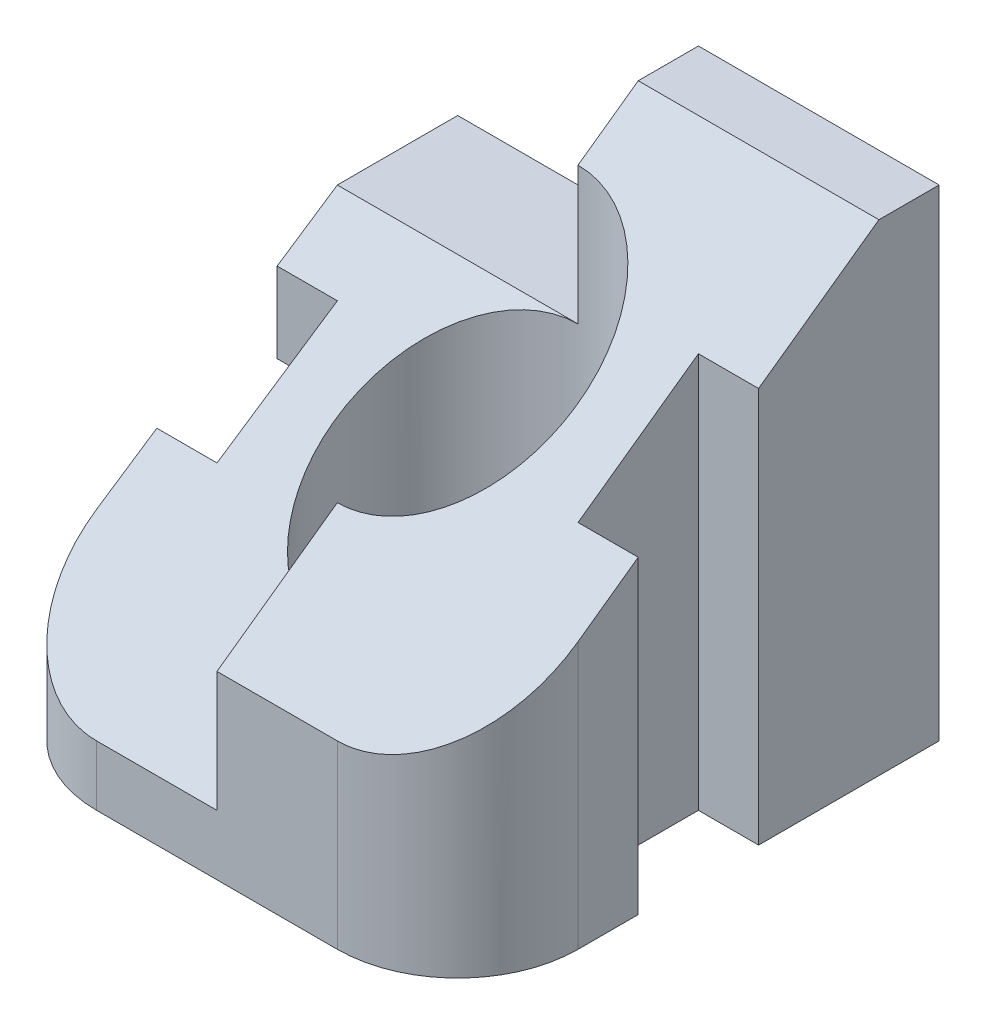
ISO-10303-21;
HEADER;
FILE_DESCRIPTION(('STEP AP214'),'2;1');
FILE_NAME('part.step','',(''),(''),'','','');
FILE_SCHEMA(('AUTOMOTIVE_DESIGN { 1 0 10303 214 1 1 1 1 }'));
ENDSEC;
DATA;
#1=APPLICATION_CONTEXT('core data for automotive mechanical design processes');
#2=APPLICATION_PROTOCOL_DEFINITION('international standard','automotive_design',2000,#1);
#3=PRODUCT_CONTEXT('',#1,'mechanical');
#4=PRODUCT('Part','Part','',(#3));
#5=PRODUCT_RELATED_PRODUCT_CATEGORY('part','',(#4));
#6=PRODUCT_DEFINITION_FORMATION('','',#4);
#7=PRODUCT_DEFINITION_CONTEXT('part definition',#1,'design');
#8=PRODUCT_DEFINITION('design','',#6,#7);
#9=PRODUCT_DEFINITION_SHAPE('','',#8);
#10=(LENGTH_UNIT() NAMED_UNIT(*) SI_UNIT(.MILLI.,.METRE.));
#11=(NAMED_UNIT(*) PLANE_ANGLE_UNIT() SI_UNIT($,.RADIAN.));
#12=(NAMED_UNIT(*) SI_UNIT($,.STERADIAN.) SOLID_ANGLE_UNIT());
#13=UNCERTAINTY_MEASURE_WITH_UNIT(LENGTH_MEASURE(1.E-05),#10,'distance_accuracy_value','');
#14=(GEOMETRIC_REPRESENTATION_CONTEXT(3) GLOBAL_UNCERTAINTY_ASSIGNED_CONTEXT((#13)) GLOBAL_UNIT_ASSIGNED_CONTEXT((#10,
#11,#12)) REPRESENTATION_CONTEXT('',''));
#15=CARTESIAN_POINT('',(0.,0.,0.));
#16=DIRECTION('',(0.,0.,1.));
#17=DIRECTION('',(1.,0.,0.));
#18=AXIS2_PLACEMENT_3D('',#15,#16,#17);
#19=CARTESIAN_POINT('',(-20.,20.,40.));
#20=DIRECTION('',(1.,0.,0.));
#21=DIRECTION('',(0.,0.,-1.));
#22=AXIS2_PLACEMENT_3D('',#19,#20,#21);
#23=PLANE('',#22);
#24=DIRECTION('',(0.,0.554700196225229,-0.832050294337844));
#25=VECTOR('',#24,1.);
#26=CARTESIAN_POINT('',(-20.,4.99999999999999,10.));
#27=LINE('',#26,#25);
#28=CARTESIAN_POINT('',(-20.,-8.33333333333334,30.));
#29=VERTEX_POINT('',#28);
#30=CARTESIAN_POINT('',(-20.,-5.00000000000001,25.));
#31=VERTEX_POINT('',#30);
#32=EDGE_CURVE('E191',#29,#31,#27,.T.);
#33=ORIENTED_EDGE('',*,*,#32,.T.);
#34=DIRECTION('',(0.,1.,0.));
#35=VECTOR('',#34,1.);
#36=CARTESIAN_POINT('',(-20.,-20.,25.));
#37=LINE('',#36,#35);
#38=CARTESIAN_POINT('',(-20.,-20.,25.));
#39=VERTEX_POINT('',#38);
#40=EDGE_CURVE('E265',#39,#31,#37,.T.);
#41=ORIENTED_EDGE('',*,*,#40,.F.);
#42=DIRECTION('',(0.,0.,-1.));
#43=VECTOR('',#42,1.);
#44=CARTESIAN_POINT('',(-20.,-20.,40.));
#45=LINE('',#44,#43);
#46=CARTESIAN_POINT('',(-20.,-20.,30.));
#47=VERTEX_POINT('',#46);
#48=EDGE_CURVE('E316',#47,#39,#45,.T.);
#49=ORIENTED_EDGE('',*,*,#48,.F.);
#50=DIRECTION('',(0.,1.,0.));
#51=VECTOR('',#50,1.);
#52=CARTESIAN_POINT('',(-20.,-20.,30.));
#53=LINE('',#52,#51);
#54=EDGE_CURVE('E254',#47,#29,#53,.T.);
#55=ORIENTED_EDGE('',*,*,#54,.T.);
#56=EDGE_LOOP('',(#33,#41,#49,#55));
#57=FACE_BOUND('',#56,.T.);
#58=ADVANCED_FACE('F33',(#57),#23,.F.);
#59=CARTESIAN_POINT('',(0.,0.,40.));
#60=DIRECTION('',(0.,0.,1.));
#61=DIRECTION('',(1.,0.,0.));
#62=AXIS2_PLACEMENT_3D('',#59,#60,#61);
#63=PLANE('',#62);
#64=DIRECTION('',(1.,0.,0.));
#65=VECTOR('',#64,1.);
#66=CARTESIAN_POINT('',(0.,-5.00000000000001,40.));
#67=LINE('',#66,#65);
#68=CARTESIAN_POINT('',(0.,-5.00000000000001,40.));
#69=VERTEX_POINT('',#68);
#70=CARTESIAN_POINT('',(10.,-5.00000000000001,40.));
#71=VERTEX_POINT('',#70);
#72=EDGE_CURVE('E173',#69,#71,#67,.T.);
#73=ORIENTED_EDGE('',*,*,#72,.F.);
#74=DIRECTION('',(0.,-1.,0.));
#75=VECTOR('',#74,1.);
#76=CARTESIAN_POINT('',(0.,-15.,40.));
#77=LINE('',#76,#75);
#78=CARTESIAN_POINT('',(0.,-15.,40.));
#79=VERTEX_POINT('',#78);
#80=EDGE_CURVE('E182',#69,#79,#77,.T.);
#81=ORIENTED_EDGE('',*,*,#80,.T.);
#82=DIRECTION('',(-1.,0.,0.));
#83=VECTOR('',#82,1.);
#84=CARTESIAN_POINT('',(0.,-15.,40.));
#85=LINE('',#84,#83);
#86=CARTESIAN_POINT('',(-10.,-15.,40.));
#87=VERTEX_POINT('',#86);
#88=EDGE_CURVE('E203',#79,#87,#85,.T.);
#89=ORIENTED_EDGE('',*,*,#88,.T.);
#90=DIRECTION('',(0.,1.,0.));
#91=VECTOR('',#90,1.);
#92=CARTESIAN_POINT('',(-10.,-20.,40.));
#93=LINE('',#92,#91);
#94=CARTESIAN_POINT('',(-10.,-20.,40.));
#95=VERTEX_POINT('',#94);
#96=EDGE_CURVE('E255',#95,#87,#93,.T.);
#97=ORIENTED_EDGE('',*,*,#96,.F.);
#98=DIRECTION('',(1.,0.,0.));
#99=VECTOR('',#98,1.);
#100=CARTESIAN_POINT('',(-20.,-20.,40.));
#101=LINE('',#100,#99);
#102=CARTESIAN_POINT('',(10.,-20.,40.));
#103=VERTEX_POINT('',#102);
#104=EDGE_CURVE('E302',#95,#103,#101,.T.);
#105=ORIENTED_EDGE('',*,*,#104,.T.);
#106=DIRECTION('',(0.,1.,0.));
#107=VECTOR('',#106,1.);
#108=CARTESIAN_POINT('',(10.,-20.,40.));
#109=LINE('',#108,#107);
#110=EDGE_CURVE('E56',#103,#71,#109,.T.);
#111=ORIENTED_EDGE('',*,*,#110,.T.);
#112=EDGE_LOOP('',(#73,#81,#89,#97,#105,#111));
#113=FACE_BOUND('',#112,.T.);
#114=ADVANCED_FACE('F180',(#113),#63,.T.);
#115=CARTESIAN_POINT('',(-20.,1.66666666666666,15.));
#116=VERTEX_POINT('',#115);
#117=CARTESIAN_POINT('',(-20.,4.99999999999999,10.));
#118=VERTEX_POINT('',#117);
#119=EDGE_CURVE('E196',#116,#118,#27,.T.);
#120=ORIENTED_EDGE('',*,*,#119,.T.);
#121=DIRECTION('',(0.,0.,1.));
#122=VECTOR('',#121,1.);
#123=CARTESIAN_POINT('',(-20.,5.,15.));
#124=LINE('',#123,#122);
#125=CARTESIAN_POINT('',(-20.,4.99999999999999,0.));
#126=VERTEX_POINT('',#125);
#127=EDGE_CURVE('E218',#126,#118,#124,.T.);
#128=ORIENTED_EDGE('',*,*,#127,.F.);
#129=DIRECTION('',(0.,-1.,0.));
#130=VECTOR('',#129,1.);
#131=CARTESIAN_POINT('',(-20.,20.,0.));
#132=LINE('',#131,#130);
#133=CARTESIAN_POINT('',(-20.,-5.00000000000001,0.));
#134=VERTEX_POINT('',#133);
#135=EDGE_CURVE('E311',#126,#134,#132,.T.);
#136=ORIENTED_EDGE('',*,*,#135,.T.);
#137=DIRECTION('',(0.,0.,-1.));
#138=VECTOR('',#137,1.);
#139=CARTESIAN_POINT('',(-20.,-5.00000000000001,0.));
#140=LINE('',#139,#138);
#141=CARTESIAN_POINT('',(-20.,-5.00000000000001,15.));
#142=VERTEX_POINT('',#141);
#143=EDGE_CURVE('E231',#142,#134,#140,.T.);
#144=ORIENTED_EDGE('',*,*,#143,.F.);
#145=DIRECTION('',(0.,1.,0.));
#146=VECTOR('',#145,1.);
#147=CARTESIAN_POINT('',(-20.,-20.,15.));
#148=LINE('',#147,#146);
#149=EDGE_CURVE('E266',#142,#116,#148,.T.);
#150=ORIENTED_EDGE('',*,*,#149,.T.);
#151=EDGE_LOOP('',(#120,#128,#136,#144,#150));
#152=FACE_BOUND('',#151,.T.);
#153=ADVANCED_FACE('F352',(#152),#23,.F.);
#154=CARTESIAN_POINT('',(0.,-20.,20.));
#155=DIRECTION('',(0.,1.,0.));
#156=DIRECTION('',(0.,0.,1.));
#157=AXIS2_PLACEMENT_3D('',#154,#155,#156);
#158=CYLINDRICAL_SURFACE('',#157,10.);
#159=CARTESIAN_POINT('',(0.,-20.,20.));
#160=DIRECTION('',(0.,1.,0.));
#161=DIRECTION('',(0.,0.,1.));
#162=AXIS2_PLACEMENT_3D('',#159,#160,#161);
#163=CIRCLE('',#162,10.);
#164=CARTESIAN_POINT('',(0.,-20.,30.));
#165=VERTEX_POINT('',#164);
#166=EDGE_CURVE('E290',#165,#165,#163,.T.);
#167=ORIENTED_EDGE('',*,*,#166,.F.);
#168=EDGE_LOOP('',(#167));
#169=FACE_BOUND('',#168,.T.);
#170=DIRECTION('',(0.,1.,0.));
#171=VECTOR('',#170,1.);
#172=CARTESIAN_POINT('',(0.,-20.,30.));
#173=LINE('',#172,#171);
#174=CARTESIAN_POINT('',(0.,-8.33333333333334,30.));
#175=VERTEX_POINT('',#174);
#176=CARTESIAN_POINT('',(0.,2.14285714285712,30.));
#177=VERTEX_POINT('',#176);
#178=EDGE_CURVE('E205',#175,#177,#173,.T.);
#179=ORIENTED_EDGE('',*,*,#178,.T.);
#180=CARTESIAN_POINT('',(0.,9.28571428571428,20.));
#181=DIRECTION('',(0.,-0.813733471206735,-0.581238193719096));
#182=DIRECTION('',(0.,0.581238193719096,-0.813733471206735));
#183=AXIS2_PLACEMENT_3D('',#180,#181,#182);
#184=ELLIPSE('',#183,12.2890360957752,10.);
#185=CARTESIAN_POINT('',(0.,16.4285714285714,9.99999999999999));
#186=VERTEX_POINT('',#185);
#187=EDGE_CURVE('E48',#177,#186,#184,.F.);
#188=ORIENTED_EDGE('',*,*,#187,.T.);
#189=DIRECTION('',(0.,1.,0.));
#190=VECTOR('',#189,1.);
#191=CARTESIAN_POINT('',(0.,-20.,9.99999999999999));
#192=LINE('',#191,#190);
#193=CARTESIAN_POINT('',(0.,4.99999999999999,10.));
#194=VERTEX_POINT('',#193);
#195=EDGE_CURVE('E11',#186,#194,#192,.F.);
#196=ORIENTED_EDGE('',*,*,#195,.T.);
#197=CARTESIAN_POINT('',(0.,-1.66666666666667,20.));
#198=DIRECTION('',(0.,0.832050294337844,0.554700196225229));
#199=DIRECTION('',(0.,0.554700196225229,-0.832050294337844));
#200=AXIS2_PLACEMENT_3D('',#197,#198,#199);
#201=ELLIPSE('',#200,12.0185042515466,10.);
#202=EDGE_CURVE('E215',#175,#194,#201,.F.);
#203=ORIENTED_EDGE('',*,*,#202,.F.);
#204=EDGE_LOOP('',(#179,#188,#196,#203));
#205=FACE_BOUND('',#204,.T.);
#206=ADVANCED_FACE('F378',(#169,#205),#158,.F.);
#207=CARTESIAN_POINT('',(-20.,-20.,15.));
#208=DIRECTION('',(0.,0.,-1.));
#209=DIRECTION('',(-1.,0.,0.));
#210=AXIS2_PLACEMENT_3D('',#207,#208,#209);
#211=PLANE('',#210);
#212=DIRECTION('',(1.,0.,0.));
#213=VECTOR('',#212,1.);
#214=CARTESIAN_POINT('',(-20.,1.66666666666666,15.));
#215=LINE('',#214,#213);
#216=CARTESIAN_POINT('',(-15.,1.66666666666666,15.));
#217=VERTEX_POINT('',#216);
#218=EDGE_CURVE('E213',#116,#217,#215,.T.);
#219=ORIENTED_EDGE('',*,*,#218,.F.);
#220=ORIENTED_EDGE('',*,*,#149,.F.);
#221=DIRECTION('',(-1.,0.,0.));
#222=VECTOR('',#221,1.);
#223=CARTESIAN_POINT('',(-15.,-5.00000000000001,15.));
#224=LINE('',#223,#222);
#225=CARTESIAN_POINT('',(-15.,-5.00000000000001,15.));
#226=VERTEX_POINT('',#225);
#227=EDGE_CURVE('E238',#226,#142,#224,.T.);
#228=ORIENTED_EDGE('',*,*,#227,.F.);
#229=DIRECTION('',(0.,1.,0.));
#230=VECTOR('',#229,1.);
#231=CARTESIAN_POINT('',(-15.,-20.,15.));
#232=LINE('',#231,#230);
#233=EDGE_CURVE('E270',#226,#217,#232,.T.);
#234=ORIENTED_EDGE('',*,*,#233,.T.);
#235=EDGE_LOOP('',(#219,#220,#228,#234));
#236=FACE_BOUND('',#235,.T.);
#237=ADVANCED_FACE('F350',(#236),#211,.F.);
#238=CARTESIAN_POINT('',(-15.,-20.,15.));
#239=DIRECTION('',(1.,0.,0.));
#240=DIRECTION('',(0.,0.,-1.));
#241=AXIS2_PLACEMENT_3D('',#238,#239,#240);
#242=PLANE('',#241);
#243=DIRECTION('',(0.,-0.554700196225229,0.832050294337844));
#244=VECTOR('',#243,1.);
#245=CARTESIAN_POINT('',(-15.,-5.00000000000001,25.));
#246=LINE('',#245,#244);
#247=CARTESIAN_POINT('',(-15.,-5.00000000000001,25.));
#248=VERTEX_POINT('',#247);
#249=EDGE_CURVE('E211',#217,#248,#246,.T.);
#250=ORIENTED_EDGE('',*,*,#249,.F.);
#251=ORIENTED_EDGE('',*,*,#233,.F.);
#252=DIRECTION('',(0.,0.,-1.));
#253=VECTOR('',#252,1.);
#254=CARTESIAN_POINT('',(-15.,-5.00000000000001,0.));
#255=LINE('',#254,#253);
#256=CARTESIAN_POINT('',(-15.,-5.00000000000001,0.));
#257=VERTEX_POINT('',#256);
#258=EDGE_CURVE('E232',#226,#257,#255,.T.);
#259=ORIENTED_EDGE('',*,*,#258,.T.);
#260=DIRECTION('',(0.,-1.,0.));
#261=VECTOR('',#260,1.);
#262=CARTESIAN_POINT('',(-15.,-20.,0.));
#263=LINE('',#262,#261);
#264=CARTESIAN_POINT('',(-15.,-20.,0.));
#265=VERTEX_POINT('',#264);
#266=EDGE_CURVE('E235',#257,#265,#263,.T.);
#267=ORIENTED_EDGE('',*,*,#266,.T.);
#268=DIRECTION('',(0.,0.,-1.));
#269=VECTOR('',#268,1.);
#270=CARTESIAN_POINT('',(-15.,-20.,15.));
#271=LINE('',#270,#269);
#272=CARTESIAN_POINT('',(-15.,-20.,25.));
#273=VERTEX_POINT('',#272);
#274=EDGE_CURVE('E263',#273,#265,#271,.T.);
#275=ORIENTED_EDGE('',*,*,#274,.F.);
#276=DIRECTION('',(0.,1.,0.));
#277=VECTOR('',#276,1.);
#278=CARTESIAN_POINT('',(-15.,-20.,25.));
#279=LINE('',#278,#277);
#280=EDGE_CURVE('E273',#273,#248,#279,.T.);
#281=ORIENTED_EDGE('',*,*,#280,.T.);
#282=EDGE_LOOP('',(#250,#251,#259,#267,#275,#281));
#283=FACE_BOUND('',#282,.T.);
#284=ADVANCED_FACE('F340',(#283),#242,.F.);
#285=CARTESIAN_POINT('',(-15.,-20.,25.));
#286=DIRECTION('',(0.,0.,1.));
#287=DIRECTION('',(1.,0.,0.));
#288=AXIS2_PLACEMENT_3D('',#285,#286,#287);
#289=PLANE('',#288);
#290=DIRECTION('',(-1.,0.,0.));
#291=VECTOR('',#290,1.);
#292=CARTESIAN_POINT('',(-15.,-5.00000000000001,25.));
#293=LINE('',#292,#291);
#294=EDGE_CURVE('E209',#248,#31,#293,.T.);
#295=ORIENTED_EDGE('',*,*,#294,.F.);
#296=ORIENTED_EDGE('',*,*,#280,.F.);
#297=DIRECTION('',(1.,0.,0.));
#298=VECTOR('',#297,1.);
#299=CARTESIAN_POINT('',(-15.,-20.,25.));
#300=LINE('',#299,#298);
#301=EDGE_CURVE('E258',#39,#273,#300,.T.);
#302=ORIENTED_EDGE('',*,*,#301,.F.);
#303=ORIENTED_EDGE('',*,*,#40,.T.);
#304=EDGE_LOOP('',(#295,#296,#302,#303));
#305=FACE_BOUND('',#304,.T.);
#306=ADVANCED_FACE('F393',(#305),#289,.F.);
#307=CARTESIAN_POINT('',(-10.,-20.,30.));
#308=DIRECTION('',(0.,1.,0.));
#309=DIRECTION('',(0.,0.,1.));
#310=AXIS2_PLACEMENT_3D('',#307,#308,#309);
#311=CYLINDRICAL_SURFACE('',#310,10.);
#312=CARTESIAN_POINT('',(-10.,-8.33333333333334,30.));
#313=DIRECTION('',(0.,0.832050294337844,0.554700196225229));
#314=DIRECTION('',(0.,0.554700196225229,-0.832050294337844));
#315=AXIS2_PLACEMENT_3D('',#312,#313,#314);
#316=ELLIPSE('',#315,12.0185042515466,10.);
#317=EDGE_CURVE('E207',#29,#87,#316,.T.);
#318=ORIENTED_EDGE('',*,*,#317,.F.);
#319=ORIENTED_EDGE('',*,*,#54,.F.);
#320=CARTESIAN_POINT('',(-10.,-20.,30.));
#321=DIRECTION('',(0.,-1.,0.));
#322=DIRECTION('',(0.,0.,-1.));
#323=AXIS2_PLACEMENT_3D('',#320,#321,#322);
#324=CIRCLE('',#323,10.);
#325=EDGE_CURVE('E250',#95,#47,#324,.T.);
#326=ORIENTED_EDGE('',*,*,#325,.F.);
#327=ORIENTED_EDGE('',*,*,#96,.T.);
#328=EDGE_LOOP('',(#318,#319,#326,#327));
#329=FACE_BOUND('',#328,.T.);
#330=ADVANCED_FACE('F386',(#329),#311,.T.);
#331=CARTESIAN_POINT('',(0.,5.,15.));
#332=DIRECTION('',(0.,-1.,0.));
#333=DIRECTION('',(0.,0.,-1.));
#334=AXIS2_PLACEMENT_3D('',#331,#332,#333);
#335=PLANE('',#334);
#336=DIRECTION('',(-1.,0.,0.));
#337=VECTOR('',#336,1.);
#338=CARTESIAN_POINT('',(0.,4.99999999999999,10.));
#339=LINE('',#338,#337);
#340=EDGE_CURVE('E193',#194,#118,#339,.T.);
#341=ORIENTED_EDGE('',*,*,#340,.F.);
#342=DIRECTION('',(0.,0.,1.));
#343=VECTOR('',#342,1.);
#344=CARTESIAN_POINT('',(0.,5.,15.));
#345=LINE('',#344,#343);
#346=CARTESIAN_POINT('',(0.,4.99999999999999,0.));
#347=VERTEX_POINT('',#346);
#348=EDGE_CURVE('E222',#347,#194,#345,.T.);
#349=ORIENTED_EDGE('',*,*,#348,.F.);
#350=DIRECTION('',(-1.,0.,0.));
#351=VECTOR('',#350,1.);
#352=CARTESIAN_POINT('',(0.,4.99999999999999,0.));
#353=LINE('',#352,#351);
#354=EDGE_CURVE('E227',#347,#126,#353,.T.);
#355=ORIENTED_EDGE('',*,*,#354,.T.);
#356=ORIENTED_EDGE('',*,*,#127,.T.);
#357=EDGE_LOOP('',(#341,#349,#355,#356));
#358=FACE_BOUND('',#357,.T.);
#359=ADVANCED_FACE('F356',(#358),#335,.F.);
#360=CARTESIAN_POINT('',(20.,20.,40.));
#361=DIRECTION('',(-1.,0.,0.));
#362=DIRECTION('',(0.,0.,1.));
#363=AXIS2_PLACEMENT_3D('',#360,#361,#362);
#364=PLANE('',#363);
#365=DIRECTION('',(0.,1.,0.));
#366=VECTOR('',#365,1.);
#367=CARTESIAN_POINT('',(20.,-20.,25.));
#368=LINE('',#367,#366);
#369=CARTESIAN_POINT('',(20.,-20.,25.));
#370=VERTEX_POINT('',#369);
#371=CARTESIAN_POINT('',(20.,5.71428571428571,25.));
#372=VERTEX_POINT('',#371);
#373=EDGE_CURVE('E287',#370,#372,#368,.T.);
#374=ORIENTED_EDGE('',*,*,#373,.T.);
#375=DIRECTION('',(0.,0.581238193719096,-0.813733471206735));
#376=VECTOR('',#375,1.);
#377=CARTESIAN_POINT('',(20.,20.,5.));
#378=LINE('',#377,#376);
#379=CARTESIAN_POINT('',(20.,2.14285714285714,30.));
#380=VERTEX_POINT('',#379);
#381=EDGE_CURVE('E361',#380,#372,#378,.T.);
#382=ORIENTED_EDGE('',*,*,#381,.F.);
#383=DIRECTION('',(0.,1.,0.));
#384=VECTOR('',#383,1.);
#385=CARTESIAN_POINT('',(20.,-20.,30.));
#386=LINE('',#385,#384);
#387=CARTESIAN_POINT('',(20.,-20.,30.));
#388=VERTEX_POINT('',#387);
#389=EDGE_CURVE('E247',#388,#380,#386,.T.);
#390=ORIENTED_EDGE('',*,*,#389,.F.);
#391=DIRECTION('',(0.,0.,-1.));
#392=VECTOR('',#391,1.);
#393=CARTESIAN_POINT('',(20.,-20.,40.));
#394=LINE('',#393,#392);
#395=EDGE_CURVE('E314',#388,#370,#394,.T.);
#396=ORIENTED_EDGE('',*,*,#395,.T.);
#397=EDGE_LOOP('',(#374,#382,#390,#396));
#398=FACE_BOUND('',#397,.T.);
#399=ADVANCED_FACE('F435',(#398),#364,.F.);
#400=DIRECTION('',(0.,0.,-1.));
#401=VECTOR('',#400,1.);
#402=CARTESIAN_POINT('',(20.,20.,40.));
#403=LINE('',#402,#401);
#404=CARTESIAN_POINT('',(20.,20.,5.));
#405=VERTEX_POINT('',#404);
#406=CARTESIAN_POINT('',(20.,20.,0.));
#407=VERTEX_POINT('',#406);
#408=EDGE_CURVE('E41',#405,#407,#403,.T.);
#409=ORIENTED_EDGE('',*,*,#408,.F.);
#410=CARTESIAN_POINT('',(20.,12.8571428571429,15.));
#411=VERTEX_POINT('',#410);
#412=EDGE_CURVE('E362',#411,#405,#378,.T.);
#413=ORIENTED_EDGE('',*,*,#412,.F.);
#414=DIRECTION('',(0.,1.,0.));
#415=VECTOR('',#414,1.);
#416=CARTESIAN_POINT('',(20.,-20.,15.));
#417=LINE('',#416,#415);
#418=CARTESIAN_POINT('',(20.,-20.,15.));
#419=VERTEX_POINT('',#418);
#420=EDGE_CURVE('E286',#419,#411,#417,.T.);
#421=ORIENTED_EDGE('',*,*,#420,.F.);
#422=CARTESIAN_POINT('',(20.,-20.,0.));
#423=VERTEX_POINT('',#422);
#424=EDGE_CURVE('E304',#419,#423,#394,.T.);
#425=ORIENTED_EDGE('',*,*,#424,.T.);
#426=DIRECTION('',(0.,1.,0.));
#427=VECTOR('',#426,1.);
#428=CARTESIAN_POINT('',(20.,20.,0.));
#429=LINE('',#428,#427);
#430=EDGE_CURVE('E301',#423,#407,#429,.T.);
#431=ORIENTED_EDGE('',*,*,#430,.T.);
#432=EDGE_LOOP('',(#409,#413,#421,#425,#431));
#433=FACE_BOUND('',#432,.T.);
#434=ADVANCED_FACE('F35',(#433),#364,.F.);
#435=CARTESIAN_POINT('',(-20.,20.,40.));
#436=DIRECTION('',(0.,-1.,0.));
#437=DIRECTION('',(0.,0.,-1.));
#438=AXIS2_PLACEMENT_3D('',#435,#436,#437);
#439=PLANE('',#438);
#440=DIRECTION('',(0.,0.,-1.));
#441=VECTOR('',#440,1.);
#442=CARTESIAN_POINT('',(0.,20.,0.));
#443=LINE('',#442,#441);
#444=CARTESIAN_POINT('',(0.,20.,5.));
#445=VERTEX_POINT('',#444);
#446=CARTESIAN_POINT('',(0.,20.,0.));
#447=VERTEX_POINT('',#446);
#448=EDGE_CURVE('E225',#445,#447,#443,.T.);
#449=ORIENTED_EDGE('',*,*,#448,.F.);
#450=DIRECTION('',(1.,0.,0.));
#451=VECTOR('',#450,1.);
#452=CARTESIAN_POINT('',(0.,20.,5.));
#453=LINE('',#452,#451);
#454=EDGE_CURVE('E185',#445,#405,#453,.T.);
#455=ORIENTED_EDGE('',*,*,#454,.T.);
#456=ORIENTED_EDGE('',*,*,#408,.T.);
#457=DIRECTION('',(-1.,0.,0.));
#458=VECTOR('',#457,1.);
#459=CARTESIAN_POINT('',(-20.,20.,0.));
#460=LINE('',#459,#458);
#461=EDGE_CURVE('E308',#407,#447,#460,.T.);
#462=ORIENTED_EDGE('',*,*,#461,.T.);
#463=EDGE_LOOP('',(#449,#455,#456,#462));
#464=FACE_BOUND('',#463,.T.);
#465=ADVANCED_FACE('F322',(#464),#439,.F.);
#466=CARTESIAN_POINT('',(-20.,-20.,40.));
#467=DIRECTION('',(0.,1.,0.));
#468=DIRECTION('',(0.,0.,1.));
#469=AXIS2_PLACEMENT_3D('',#466,#467,#468);
#470=PLANE('',#469);
#471=ORIENTED_EDGE('',*,*,#166,.T.);
#472=EDGE_LOOP('',(#471));
#473=FACE_BOUND('',#472,.T.);
#474=ORIENTED_EDGE('',*,*,#274,.T.);
#475=DIRECTION('',(1.,0.,0.));
#476=VECTOR('',#475,1.);
#477=CARTESIAN_POINT('',(-20.,-20.,0.));
#478=LINE('',#477,#476);
#479=EDGE_CURVE('E305',#265,#423,#478,.T.);
#480=ORIENTED_EDGE('',*,*,#479,.T.);
#481=ORIENTED_EDGE('',*,*,#424,.F.);
#482=DIRECTION('',(-1.,0.,0.));
#483=VECTOR('',#482,1.);
#484=CARTESIAN_POINT('',(20.,-20.,15.));
#485=LINE('',#484,#483);
#486=CARTESIAN_POINT('',(15.,-20.,15.));
#487=VERTEX_POINT('',#486);
#488=EDGE_CURVE('E269',#419,#487,#485,.T.);
#489=ORIENTED_EDGE('',*,*,#488,.T.);
#490=DIRECTION('',(0.,0.,1.));
#491=VECTOR('',#490,1.);
#492=CARTESIAN_POINT('',(15.,-20.,15.));
#493=LINE('',#492,#491);
#494=CARTESIAN_POINT('',(15.,-20.,25.));
#495=VERTEX_POINT('',#494);
#496=EDGE_CURVE('E280',#487,#495,#493,.T.);
#497=ORIENTED_EDGE('',*,*,#496,.T.);
#498=DIRECTION('',(1.,0.,0.));
#499=VECTOR('',#498,1.);
#500=CARTESIAN_POINT('',(15.,-20.,25.));
#501=LINE('',#500,#499);
#502=EDGE_CURVE('E283',#495,#370,#501,.T.);
#503=ORIENTED_EDGE('',*,*,#502,.T.);
#504=ORIENTED_EDGE('',*,*,#395,.F.);
#505=CARTESIAN_POINT('',(10.,-20.,30.));
#506=DIRECTION('',(0.,-1.,0.));
#507=DIRECTION('',(0.,0.,1.));
#508=AXIS2_PLACEMENT_3D('',#505,#506,#507);
#509=CIRCLE('',#508,10.);
#510=EDGE_CURVE('E244',#388,#103,#509,.T.);
#511=ORIENTED_EDGE('',*,*,#510,.T.);
#512=ORIENTED_EDGE('',*,*,#104,.F.);
#513=ORIENTED_EDGE('',*,*,#325,.T.);
#514=ORIENTED_EDGE('',*,*,#48,.T.);
#515=ORIENTED_EDGE('',*,*,#301,.T.);
#516=EDGE_LOOP('',(#474,#480,#481,#489,#497,#503,#504,#511,#512,#513,#514,#515));
#517=FACE_BOUND('',#516,.T.);
#518=ADVANCED_FACE('F336',(#473,#517),#470,.F.);
#519=CARTESIAN_POINT('',(0.,0.,0.));
#520=DIRECTION('',(0.,0.,1.));
#521=DIRECTION('',(1.,0.,0.));
#522=AXIS2_PLACEMENT_3D('',#519,#520,#521);
#523=PLANE('',#522);
#524=ORIENTED_EDGE('',*,*,#135,.F.);
#525=ORIENTED_EDGE('',*,*,#354,.F.);
#526=DIRECTION('',(0.,-1.,0.));
#527=VECTOR('',#526,1.);
#528=CARTESIAN_POINT('',(0.,4.99999999999999,0.));
#529=LINE('',#528,#527);
#530=EDGE_CURVE('E219',#447,#347,#529,.T.);
#531=ORIENTED_EDGE('',*,*,#530,.F.);
#532=ORIENTED_EDGE('',*,*,#461,.F.);
#533=ORIENTED_EDGE('',*,*,#430,.F.);
#534=ORIENTED_EDGE('',*,*,#479,.F.);
#535=ORIENTED_EDGE('',*,*,#266,.F.);
#536=DIRECTION('',(-1.,0.,0.));
#537=VECTOR('',#536,1.);
#538=CARTESIAN_POINT('',(-15.,-5.00000000000001,0.));
#539=LINE('',#538,#537);
#540=EDGE_CURVE('E241',#257,#134,#539,.T.);
#541=ORIENTED_EDGE('',*,*,#540,.T.);
#542=EDGE_LOOP('',(#524,#525,#531,#532,#533,#534,#535,#541));
#543=FACE_BOUND('',#542,.T.);
#544=ADVANCED_FACE('F329',(#543),#523,.F.);
#545=CARTESIAN_POINT('',(15.,-20.,25.));
#546=DIRECTION('',(0.,0.,1.));
#547=DIRECTION('',(1.,0.,0.));
#548=AXIS2_PLACEMENT_3D('',#545,#546,#547);
#549=PLANE('',#548);
#550=DIRECTION('',(0.,1.,0.));
#551=VECTOR('',#550,1.);
#552=CARTESIAN_POINT('',(15.,-20.,25.));
#553=LINE('',#552,#551);
#554=CARTESIAN_POINT('',(15.,5.71428571428571,25.));
#555=VERTEX_POINT('',#554);
#556=EDGE_CURVE('E291',#495,#555,#553,.T.);
#557=ORIENTED_EDGE('',*,*,#556,.T.);
#558=DIRECTION('',(1.,0.,0.));
#559=VECTOR('',#558,1.);
#560=CARTESIAN_POINT('',(15.,5.71428571428571,25.));
#561=LINE('',#560,#559);
#562=EDGE_CURVE('E373',#555,#372,#561,.T.);
#563=ORIENTED_EDGE('',*,*,#562,.T.);
#564=ORIENTED_EDGE('',*,*,#373,.F.);
#565=ORIENTED_EDGE('',*,*,#502,.F.);
#566=EDGE_LOOP('',(#557,#563,#564,#565));
#567=FACE_BOUND('',#566,.T.);
#568=ADVANCED_FACE('F426',(#567),#549,.F.);
#569=CARTESIAN_POINT('',(15.,-20.,15.));
#570=DIRECTION('',(-1.,0.,0.));
#571=DIRECTION('',(0.,0.,1.));
#572=AXIS2_PLACEMENT_3D('',#569,#570,#571);
#573=PLANE('',#572);
#574=DIRECTION('',(0.,1.,0.));
#575=VECTOR('',#574,1.);
#576=CARTESIAN_POINT('',(15.,-20.,15.));
#577=LINE('',#576,#575);
#578=CARTESIAN_POINT('',(15.,12.8571428571429,15.));
#579=VERTEX_POINT('',#578);
#580=EDGE_CURVE('E294',#487,#579,#577,.T.);
#581=ORIENTED_EDGE('',*,*,#580,.T.);
#582=DIRECTION('',(0.,-0.581238193719096,0.813733471206735));
#583=VECTOR('',#582,1.);
#584=CARTESIAN_POINT('',(15.,1.75675675675675,30.5405405405405));
#585=LINE('',#584,#583);
#586=EDGE_CURVE('E371',#579,#555,#585,.T.);
#587=ORIENTED_EDGE('',*,*,#586,.T.);
#588=ORIENTED_EDGE('',*,*,#556,.F.);
#589=ORIENTED_EDGE('',*,*,#496,.F.);
#590=EDGE_LOOP('',(#581,#587,#588,#589));
#591=FACE_BOUND('',#590,.T.);
#592=ADVANCED_FACE('F450',(#591),#573,.F.);
#593=CARTESIAN_POINT('',(20.,-20.,15.));
#594=DIRECTION('',(0.,0.,-1.));
#595=DIRECTION('',(-1.,0.,0.));
#596=AXIS2_PLACEMENT_3D('',#593,#594,#595);
#597=PLANE('',#596);
#598=ORIENTED_EDGE('',*,*,#420,.T.);
#599=DIRECTION('',(-1.,0.,0.));
#600=VECTOR('',#599,1.);
#601=CARTESIAN_POINT('',(20.,12.8571428571429,15.));
#602=LINE('',#601,#600);
#603=EDGE_CURVE('E368',#411,#579,#602,.T.);
#604=ORIENTED_EDGE('',*,*,#603,.T.);
#605=ORIENTED_EDGE('',*,*,#580,.F.);
#606=ORIENTED_EDGE('',*,*,#488,.F.);
#607=EDGE_LOOP('',(#598,#604,#605,#606));
#608=FACE_BOUND('',#607,.T.);
#609=ADVANCED_FACE('F422',(#608),#597,.F.);
#610=CARTESIAN_POINT('',(10.,-20.,30.));
#611=DIRECTION('',(0.,1.,0.));
#612=DIRECTION('',(0.,0.,1.));
#613=AXIS2_PLACEMENT_3D('',#610,#611,#612);
#614=CYLINDRICAL_SURFACE('',#613,10.);
#615=ORIENTED_EDGE('',*,*,#389,.T.);
#616=CARTESIAN_POINT('',(10.,2.14285714285714,30.));
#617=DIRECTION('',(0.,-0.813733471206735,-0.581238193719096));
#618=DIRECTION('',(0.,0.581238193719096,-0.813733471206735));
#619=AXIS2_PLACEMENT_3D('',#616,#617,#618);
#620=ELLIPSE('',#619,12.2890360957752,10.);
#621=EDGE_CURVE('E365',#380,#71,#620,.T.);
#622=ORIENTED_EDGE('',*,*,#621,.T.);
#623=ORIENTED_EDGE('',*,*,#110,.F.);
#624=ORIENTED_EDGE('',*,*,#510,.F.);
#625=EDGE_LOOP('',(#615,#622,#623,#624));
#626=FACE_BOUND('',#625,.T.);
#627=ADVANCED_FACE('F452',(#626),#614,.T.);
#628=CARTESIAN_POINT('',(-15.,-5.00000000000001,0.));
#629=DIRECTION('',(0.,1.,0.));
#630=DIRECTION('',(0.,0.,1.));
#631=AXIS2_PLACEMENT_3D('',#628,#629,#630);
#632=PLANE('',#631);
#633=ORIENTED_EDGE('',*,*,#143,.T.);
#634=ORIENTED_EDGE('',*,*,#540,.F.);
#635=ORIENTED_EDGE('',*,*,#258,.F.);
#636=ORIENTED_EDGE('',*,*,#227,.T.);
#637=EDGE_LOOP('',(#633,#634,#635,#636));
#638=FACE_BOUND('',#637,.T.);
#639=ADVANCED_FACE('F345',(#638),#632,.F.);
#640=CARTESIAN_POINT('',(0.,0.,0.));
#641=DIRECTION('',(1.,0.,0.));
#642=DIRECTION('',(0.,0.,-1.));
#643=AXIS2_PLACEMENT_3D('',#640,#641,#642);
#644=PLANE('',#643);
#645=ORIENTED_EDGE('',*,*,#195,.F.);
#646=DIRECTION('',(0.,0.581238193719096,-0.813733471206735));
#647=VECTOR('',#646,1.);
#648=CARTESIAN_POINT('',(0.,20.,5.));
#649=LINE('',#648,#647);
#650=EDGE_CURVE('E177',#186,#445,#649,.T.);
#651=ORIENTED_EDGE('',*,*,#650,.T.);
#652=ORIENTED_EDGE('',*,*,#448,.T.);
#653=ORIENTED_EDGE('',*,*,#530,.T.);
#654=ORIENTED_EDGE('',*,*,#348,.T.);
#655=EDGE_LOOP('',(#645,#651,#652,#653,#654));
#656=FACE_BOUND('',#655,.T.);
#657=ADVANCED_FACE('F359',(#656),#644,.F.);
#658=CARTESIAN_POINT('',(0.,4.99999999999999,10.));
#659=DIRECTION('',(0.,0.832050294337844,0.554700196225229));
#660=DIRECTION('',(0.,-0.554700196225229,0.832050294337844));
#661=AXIS2_PLACEMENT_3D('',#658,#659,#660);
#662=PLANE('',#661);
#663=ORIENTED_EDGE('',*,*,#202,.T.);
#664=ORIENTED_EDGE('',*,*,#340,.T.);
#665=ORIENTED_EDGE('',*,*,#119,.F.);
#666=ORIENTED_EDGE('',*,*,#218,.T.);
#667=ORIENTED_EDGE('',*,*,#249,.T.);
#668=ORIENTED_EDGE('',*,*,#294,.T.);
#669=ORIENTED_EDGE('',*,*,#32,.F.);
#670=ORIENTED_EDGE('',*,*,#317,.T.);
#671=ORIENTED_EDGE('',*,*,#88,.F.);
#672=DIRECTION('',(0.,0.554700196225229,-0.832050294337844));
#673=VECTOR('',#672,1.);
#674=CARTESIAN_POINT('',(0.,4.99999999999999,10.));
#675=LINE('',#674,#673);
#676=EDGE_CURVE('E190',#79,#175,#675,.T.);
#677=ORIENTED_EDGE('',*,*,#676,.T.);
#678=EDGE_LOOP('',(#663,#664,#665,#666,#667,#668,#669,#670,#671,#677));
#679=FACE_BOUND('',#678,.T.);
#680=ADVANCED_FACE('F381',(#679),#662,.T.);
#681=CARTESIAN_POINT('',(0.,0.,0.));
#682=DIRECTION('',(1.,0.,0.));
#683=DIRECTION('',(0.,0.,-1.));
#684=AXIS2_PLACEMENT_3D('',#681,#682,#683);
#685=PLANE('',#684);
#686=ORIENTED_EDGE('',*,*,#80,.F.);
#687=EDGE_CURVE('E170',#69,#177,#649,.T.);
#688=ORIENTED_EDGE('',*,*,#687,.T.);
#689=ORIENTED_EDGE('',*,*,#178,.F.);
#690=ORIENTED_EDGE('',*,*,#676,.F.);
#691=EDGE_LOOP('',(#686,#688,#689,#690));
#692=FACE_BOUND('',#691,.T.);
#693=ADVANCED_FACE('F188',(#692),#685,.F.);
#694=CARTESIAN_POINT('',(0.,20.,5.));
#695=DIRECTION('',(0.,-0.813733471206735,-0.581238193719096));
#696=DIRECTION('',(0.,0.581238193719096,-0.813733471206735));
#697=AXIS2_PLACEMENT_3D('',#694,#695,#696);
#698=PLANE('',#697);
#699=ORIENTED_EDGE('',*,*,#687,.F.);
#700=ORIENTED_EDGE('',*,*,#72,.T.);
#701=ORIENTED_EDGE('',*,*,#621,.F.);
#702=ORIENTED_EDGE('',*,*,#381,.T.);
#703=ORIENTED_EDGE('',*,*,#562,.F.);
#704=ORIENTED_EDGE('',*,*,#586,.F.);
#705=ORIENTED_EDGE('',*,*,#603,.F.);
#706=ORIENTED_EDGE('',*,*,#412,.T.);
#707=ORIENTED_EDGE('',*,*,#454,.F.);
#708=ORIENTED_EDGE('',*,*,#650,.F.);
#709=ORIENTED_EDGE('',*,*,#187,.F.);
#710=EDGE_LOOP('',(#699,#700,#701,#702,#703,#704,#705,#706,#707,#708,#709));
#711=FACE_BOUND('',#710,.T.);
#712=ADVANCED_FACE('F172',(#711),#698,.F.);
#713=CLOSED_SHELL('',(#58,#114,#153,#206,#237,#284,#306,#330,#359,#399,#434,#465,#518,#544,#568,
#592,#609,#627,#639,#657,#680,#693,#712));
#714=MANIFOLD_SOLID_BREP('B2',#713);
#715=ADVANCED_BREP_SHAPE_REPRESENTATION('',(#18,#714),#14);
#716=SHAPE_DEFINITION_REPRESENTATION(#9,#715);
ENDSEC;
END-ISO-10303-21;
